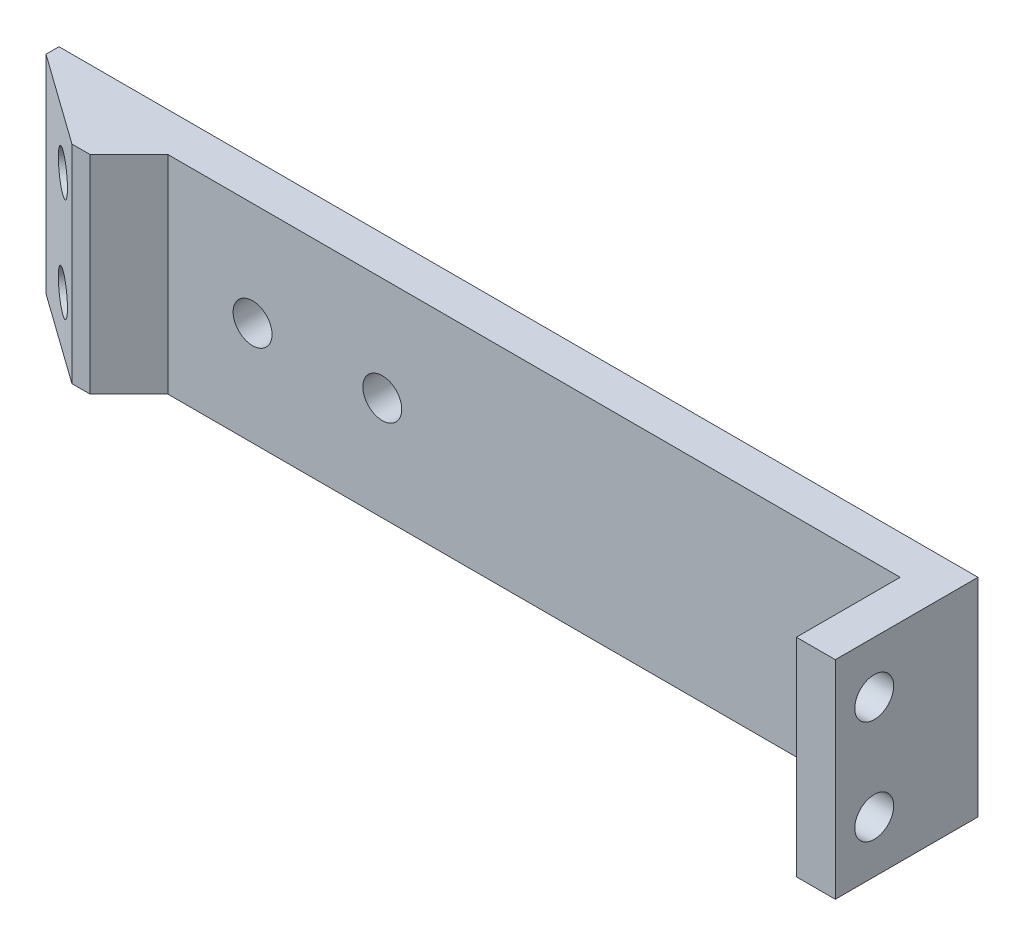
ISO-10303-21;
HEADER;
FILE_DESCRIPTION(('STEP AP214'),'2;1');
FILE_NAME('part.step','',(''),(''),'','','');
FILE_SCHEMA(('AUTOMOTIVE_DESIGN { 1 0 10303 214 1 1 1 1 }'));
ENDSEC;
DATA;
#1=APPLICATION_CONTEXT('core data for automotive mechanical design processes');
#2=APPLICATION_PROTOCOL_DEFINITION('international standard','automotive_design',2000,#1);
#3=PRODUCT_CONTEXT('',#1,'mechanical');
#4=PRODUCT('Part','Part','',(#3));
#5=PRODUCT_RELATED_PRODUCT_CATEGORY('part','',(#4));
#6=PRODUCT_DEFINITION_FORMATION('','',#4);
#7=PRODUCT_DEFINITION_CONTEXT('part definition',#1,'design');
#8=PRODUCT_DEFINITION('design','',#6,#7);
#9=PRODUCT_DEFINITION_SHAPE('','',#8);
#10=(LENGTH_UNIT() NAMED_UNIT(*) SI_UNIT(.MILLI.,.METRE.));
#11=(NAMED_UNIT(*) PLANE_ANGLE_UNIT() SI_UNIT($,.RADIAN.));
#12=(NAMED_UNIT(*) SI_UNIT($,.STERADIAN.) SOLID_ANGLE_UNIT());
#13=UNCERTAINTY_MEASURE_WITH_UNIT(LENGTH_MEASURE(1.E-05),#10,'distance_accuracy_value','');
#14=(GEOMETRIC_REPRESENTATION_CONTEXT(3) GLOBAL_UNCERTAINTY_ASSIGNED_CONTEXT((#13)) GLOBAL_UNIT_ASSIGNED_CONTEXT((#10,
#11,#12)) REPRESENTATION_CONTEXT('',''));
#15=CARTESIAN_POINT('',(0.,0.,0.));
#16=DIRECTION('',(0.,0.,1.));
#17=DIRECTION('',(1.,0.,0.));
#18=AXIS2_PLACEMENT_3D('',#15,#16,#17);
#19=CARTESIAN_POINT('',(0.,0.,3.));
#20=DIRECTION('',(0.,0.,-1.));
#21=DIRECTION('',(-1.,0.,0.));
#22=AXIS2_PLACEMENT_3D('',#19,#20,#21);
#23=PLANE('',#22);
#24=CARTESIAN_POINT('',(-7.5,0.,3.));
#25=DIRECTION('',(0.,0.,1.));
#26=DIRECTION('',(1.,0.,0.));
#27=AXIS2_PLACEMENT_3D('',#24,#25,#26);
#28=CIRCLE('',#27,1.5);
#29=CARTESIAN_POINT('',(-6.,0.,3.));
#30=VERTEX_POINT('',#29);
#31=EDGE_CURVE('E681',#30,#30,#28,.T.);
#32=ORIENTED_EDGE('',*,*,#31,.F.);
#33=EDGE_LOOP('',(#32));
#34=FACE_BOUND('',#33,.T.);
#35=CARTESIAN_POINT('',(-17.5,0.,3.));
#36=DIRECTION('',(0.,0.,-1.));
#37=DIRECTION('',(-1.,0.,0.));
#38=AXIS2_PLACEMENT_3D('',#35,#36,#37);
#39=CIRCLE('',#38,1.5);
#40=CARTESIAN_POINT('',(-19.,0.,3.));
#41=VERTEX_POINT('',#40);
#42=EDGE_CURVE('E687',#41,#41,#39,.T.);
#43=ORIENTED_EDGE('',*,*,#42,.T.);
#44=EDGE_LOOP('',(#43));
#45=FACE_BOUND('',#44,.T.);
#46=DIRECTION('',(0.,-1.,0.));
#47=VECTOR('',#46,1.);
#48=CARTESIAN_POINT('',(32.425,8.,3.));
#49=LINE('',#48,#47);
#50=CARTESIAN_POINT('',(32.425,8.,3.));
#51=VERTEX_POINT('',#50);
#52=CARTESIAN_POINT('',(32.425,-8.,3.));
#53=VERTEX_POINT('',#52);
#54=EDGE_CURVE('E53',#51,#53,#49,.T.);
#55=ORIENTED_EDGE('',*,*,#54,.F.);
#56=DIRECTION('',(-1.,0.,0.));
#57=VECTOR('',#56,1.);
#58=CARTESIAN_POINT('',(-35.425,8.,3.));
#59=LINE('',#58,#57);
#60=CARTESIAN_POINT('',(-24.025,8.,3.));
#61=VERTEX_POINT('',#60);
#62=EDGE_CURVE('E296',#51,#61,#59,.T.);
#63=ORIENTED_EDGE('',*,*,#62,.T.);
#64=DIRECTION('',(0.,-1.,0.));
#65=VECTOR('',#64,1.);
#66=CARTESIAN_POINT('',(-24.025,-8.,3.));
#67=LINE('',#66,#65);
#68=CARTESIAN_POINT('',(-24.025,-8.,3.));
#69=VERTEX_POINT('',#68);
#70=EDGE_CURVE('E320',#61,#69,#67,.T.);
#71=ORIENTED_EDGE('',*,*,#70,.T.);
#72=DIRECTION('',(1.,0.,0.));
#73=VECTOR('',#72,1.);
#74=CARTESIAN_POINT('',(-35.425,-8.,3.));
#75=LINE('',#74,#73);
#76=EDGE_CURVE('E58',#69,#53,#75,.T.);
#77=ORIENTED_EDGE('',*,*,#76,.T.);
#78=EDGE_LOOP('',(#55,#63,#71,#77));
#79=FACE_BOUND('',#78,.T.);
#80=ADVANCED_FACE('F35',(#34,#45,#79),#23,.F.);
#81=CARTESIAN_POINT('',(35.425,-8.,3.));
#82=DIRECTION('',(-1.,0.,0.));
#83=DIRECTION('',(0.,0.,1.));
#84=AXIS2_PLACEMENT_3D('',#81,#82,#83);
#85=PLANE('',#84);
#86=CARTESIAN_POINT('',(35.425,4.,8.));
#87=DIRECTION('',(1.,0.,0.));
#88=DIRECTION('',(0.,0.,-1.));
#89=AXIS2_PLACEMENT_3D('',#86,#87,#88);
#90=CIRCLE('',#89,1.5);
#91=CARTESIAN_POINT('',(35.425,4.,6.5));
#92=VERTEX_POINT('',#91);
#93=EDGE_CURVE('E356',#92,#92,#90,.T.);
#94=ORIENTED_EDGE('',*,*,#93,.F.);
#95=EDGE_LOOP('',(#94));
#96=FACE_BOUND('',#95,.T.);
#97=CARTESIAN_POINT('',(35.425,-4.,8.));
#98=DIRECTION('',(1.,0.,0.));
#99=DIRECTION('',(0.,0.,-1.));
#100=AXIS2_PLACEMENT_3D('',#97,#98,#99);
#101=CIRCLE('',#100,1.5);
#102=CARTESIAN_POINT('',(35.425,-4.,6.5));
#103=VERTEX_POINT('',#102);
#104=EDGE_CURVE('E210',#103,#103,#101,.T.);
#105=ORIENTED_EDGE('',*,*,#104,.F.);
#106=EDGE_LOOP('',(#105));
#107=FACE_BOUND('',#106,.T.);
#108=DIRECTION('',(0.,1.,0.));
#109=VECTOR('',#108,1.);
#110=CARTESIAN_POINT('',(35.425,-8.,0.));
#111=LINE('',#110,#109);
#112=CARTESIAN_POINT('',(35.425,-8.,0.));
#113=VERTEX_POINT('',#112);
#114=CARTESIAN_POINT('',(35.425,8.,0.));
#115=VERTEX_POINT('',#114);
#116=EDGE_CURVE('E186',#113,#115,#111,.T.);
#117=ORIENTED_EDGE('',*,*,#116,.T.);
#118=DIRECTION('',(0.,0.,-1.));
#119=VECTOR('',#118,1.);
#120=CARTESIAN_POINT('',(35.425,8.,3.));
#121=LINE('',#120,#119);
#122=CARTESIAN_POINT('',(35.425,8.,11.));
#123=VERTEX_POINT('',#122);
#124=EDGE_CURVE('E179',#123,#115,#121,.T.);
#125=ORIENTED_EDGE('',*,*,#124,.F.);
#126=DIRECTION('',(0.,1.,0.));
#127=VECTOR('',#126,1.);
#128=CARTESIAN_POINT('',(35.425,8.,11.));
#129=LINE('',#128,#127);
#130=CARTESIAN_POINT('',(35.425,-8.,11.));
#131=VERTEX_POINT('',#130);
#132=EDGE_CURVE('E184',#131,#123,#129,.T.);
#133=ORIENTED_EDGE('',*,*,#132,.F.);
#134=DIRECTION('',(0.,0.,-1.));
#135=VECTOR('',#134,1.);
#136=CARTESIAN_POINT('',(35.425,-8.,3.));
#137=LINE('',#136,#135);
#138=EDGE_CURVE('E300',#131,#113,#137,.T.);
#139=ORIENTED_EDGE('',*,*,#138,.T.);
#140=EDGE_LOOP('',(#117,#125,#133,#139));
#141=FACE_BOUND('',#140,.T.);
#142=ADVANCED_FACE('F181',(#96,#107,#141),#85,.F.);
#143=CARTESIAN_POINT('',(-35.425,8.,3.));
#144=DIRECTION('',(0.,-1.,0.));
#145=DIRECTION('',(0.,0.,-1.));
#146=AXIS2_PLACEMENT_3D('',#143,#144,#145);
#147=PLANE('',#146);
#148=DIRECTION('',(0.,0.,-1.));
#149=VECTOR('',#148,1.);
#150=CARTESIAN_POINT('',(-35.425,8.,3.));
#151=LINE('',#150,#149);
#152=CARTESIAN_POINT('',(-35.425,8.,0.999999999999988));
#153=VERTEX_POINT('',#152);
#154=CARTESIAN_POINT('',(-35.425,8.,0.));
#155=VERTEX_POINT('',#154);
#156=EDGE_CURVE('E190',#153,#155,#151,.T.);
#157=ORIENTED_EDGE('',*,*,#156,.F.);
#158=DIRECTION('',(0.813733471206736,0.,0.581238193719095));
#159=VECTOR('',#158,1.);
#160=CARTESIAN_POINT('',(-28.425,8.,6.));
#161=LINE('',#160,#159);
#162=CARTESIAN_POINT('',(-28.425,8.,6.));
#163=VERTEX_POINT('',#162);
#164=EDGE_CURVE('E318',#153,#163,#161,.T.);
#165=ORIENTED_EDGE('',*,*,#164,.T.);
#166=DIRECTION('',(-1.,0.,0.));
#167=VECTOR('',#166,1.);
#168=CARTESIAN_POINT('',(-35.425,8.,6.));
#169=LINE('',#168,#167);
#170=CARTESIAN_POINT('',(-27.025,8.,6.));
#171=VERTEX_POINT('',#170);
#172=EDGE_CURVE('E293',#171,#163,#169,.T.);
#173=ORIENTED_EDGE('',*,*,#172,.F.);
#174=DIRECTION('',(-0.707106781186546,0.,0.707106781186549));
#175=VECTOR('',#174,1.);
#176=CARTESIAN_POINT('',(-29.725,8.,8.69999999999999));
#177=LINE('',#176,#175);
#178=EDGE_CURVE('E322',#171,#61,#177,.F.);
#179=ORIENTED_EDGE('',*,*,#178,.T.);
#180=ORIENTED_EDGE('',*,*,#62,.F.);
#181=DIRECTION('',(0.,0.,-1.));
#182=VECTOR('',#181,1.);
#183=CARTESIAN_POINT('',(32.425,8.,11.));
#184=LINE('',#183,#182);
#185=CARTESIAN_POINT('',(32.425,8.,11.));
#186=VERTEX_POINT('',#185);
#187=EDGE_CURVE('E197',#186,#51,#184,.T.);
#188=ORIENTED_EDGE('',*,*,#187,.F.);
#189=DIRECTION('',(-1.,0.,0.));
#190=VECTOR('',#189,1.);
#191=CARTESIAN_POINT('',(35.425,8.,11.));
#192=LINE('',#191,#190);
#193=EDGE_CURVE('E193',#123,#186,#192,.T.);
#194=ORIENTED_EDGE('',*,*,#193,.F.);
#195=ORIENTED_EDGE('',*,*,#124,.T.);
#196=DIRECTION('',(-1.,0.,0.));
#197=VECTOR('',#196,1.);
#198=CARTESIAN_POINT('',(-35.425,8.,0.));
#199=LINE('',#198,#197);
#200=EDGE_CURVE('E302',#115,#155,#199,.T.);
#201=ORIENTED_EDGE('',*,*,#200,.T.);
#202=EDGE_LOOP('',(#157,#165,#173,#179,#180,#188,#194,#195,#201));
#203=FACE_BOUND('',#202,.T.);
#204=ADVANCED_FACE('F195',(#203),#147,.F.);
#205=CARTESIAN_POINT('',(-35.425,-8.,3.));
#206=DIRECTION('',(1.,0.,0.));
#207=DIRECTION('',(0.,0.,-1.));
#208=AXIS2_PLACEMENT_3D('',#205,#206,#207);
#209=PLANE('',#208);
#210=DIRECTION('',(0.,0.,-1.));
#211=VECTOR('',#210,1.);
#212=CARTESIAN_POINT('',(-35.425,-8.,3.));
#213=LINE('',#212,#211);
#214=CARTESIAN_POINT('',(-35.425,-8.,0.999999999999988));
#215=VERTEX_POINT('',#214);
#216=CARTESIAN_POINT('',(-35.425,-8.,0.));
#217=VERTEX_POINT('',#216);
#218=EDGE_CURVE('E309',#215,#217,#213,.T.);
#219=ORIENTED_EDGE('',*,*,#218,.F.);
#220=DIRECTION('',(0.,1.,0.));
#221=VECTOR('',#220,1.);
#222=CARTESIAN_POINT('',(-35.425,8.,0.999999999999988));
#223=LINE('',#222,#221);
#224=EDGE_CURVE('E316',#215,#153,#223,.T.);
#225=ORIENTED_EDGE('',*,*,#224,.T.);
#226=ORIENTED_EDGE('',*,*,#156,.T.);
#227=DIRECTION('',(0.,-1.,0.));
#228=VECTOR('',#227,1.);
#229=CARTESIAN_POINT('',(-35.425,-8.,0.));
#230=LINE('',#229,#228);
#231=EDGE_CURVE('E304',#155,#217,#230,.T.);
#232=ORIENTED_EDGE('',*,*,#231,.T.);
#233=EDGE_LOOP('',(#219,#225,#226,#232));
#234=FACE_BOUND('',#233,.T.);
#235=ADVANCED_FACE('F400',(#234),#209,.F.);
#236=CARTESIAN_POINT('',(-35.425,-8.,3.));
#237=DIRECTION('',(0.,1.,0.));
#238=DIRECTION('',(0.,0.,1.));
#239=AXIS2_PLACEMENT_3D('',#236,#237,#238);
#240=PLANE('',#239);
#241=DIRECTION('',(1.,0.,0.));
#242=VECTOR('',#241,1.);
#243=CARTESIAN_POINT('',(-35.425,-8.,6.));
#244=LINE('',#243,#242);
#245=CARTESIAN_POINT('',(-28.425,-8.,6.));
#246=VERTEX_POINT('',#245);
#247=CARTESIAN_POINT('',(-27.025,-8.,6.));
#248=VERTEX_POINT('',#247);
#249=EDGE_CURVE('E283',#246,#248,#244,.T.);
#250=ORIENTED_EDGE('',*,*,#249,.F.);
#251=DIRECTION('',(-0.813733471206736,0.,-0.581238193719095));
#252=VECTOR('',#251,1.);
#253=CARTESIAN_POINT('',(-28.425,-8.,6.));
#254=LINE('',#253,#252);
#255=EDGE_CURVE('E314',#246,#215,#254,.T.);
#256=ORIENTED_EDGE('',*,*,#255,.T.);
#257=ORIENTED_EDGE('',*,*,#218,.T.);
#258=DIRECTION('',(1.,0.,0.));
#259=VECTOR('',#258,1.);
#260=CARTESIAN_POINT('',(-35.425,-8.,0.));
#261=LINE('',#260,#259);
#262=EDGE_CURVE('E298',#217,#113,#261,.T.);
#263=ORIENTED_EDGE('',*,*,#262,.T.);
#264=ORIENTED_EDGE('',*,*,#138,.F.);
#265=DIRECTION('',(1.,0.,0.));
#266=VECTOR('',#265,1.);
#267=CARTESIAN_POINT('',(35.425,-8.,11.));
#268=LINE('',#267,#266);
#269=CARTESIAN_POINT('',(32.425,-8.,11.));
#270=VERTEX_POINT('',#269);
#271=EDGE_CURVE('E205',#270,#131,#268,.T.);
#272=ORIENTED_EDGE('',*,*,#271,.F.);
#273=DIRECTION('',(0.,0.,-1.));
#274=VECTOR('',#273,1.);
#275=CARTESIAN_POINT('',(32.425,-8.,11.));
#276=LINE('',#275,#274);
#277=EDGE_CURVE('E214',#270,#53,#276,.T.);
#278=ORIENTED_EDGE('',*,*,#277,.T.);
#279=ORIENTED_EDGE('',*,*,#76,.F.);
#280=DIRECTION('',(0.707106781186546,0.,-0.707106781186549));
#281=VECTOR('',#280,1.);
#282=CARTESIAN_POINT('',(-29.725,-8.,8.69999999999999));
#283=LINE('',#282,#281);
#284=EDGE_CURVE('E325',#69,#248,#283,.F.);
#285=ORIENTED_EDGE('',*,*,#284,.T.);
#286=EDGE_LOOP('',(#250,#256,#257,#263,#264,#272,#278,#279,#285));
#287=FACE_BOUND('',#286,.T.);
#288=ADVANCED_FACE('F396',(#287),#240,.F.);
#289=CARTESIAN_POINT('',(0.,0.,0.));
#290=DIRECTION('',(0.,0.,-1.));
#291=DIRECTION('',(-1.,0.,0.));
#292=AXIS2_PLACEMENT_3D('',#289,#290,#291);
#293=PLANE('',#292);
#294=CARTESIAN_POINT('',(-7.5,0.,0.));
#295=DIRECTION('',(0.,0.,-1.));
#296=DIRECTION('',(-1.,0.,0.));
#297=AXIS2_PLACEMENT_3D('',#294,#295,#296);
#298=CIRCLE('',#297,1.5);
#299=CARTESIAN_POINT('',(-9.,0.,0.));
#300=VERTEX_POINT('',#299);
#301=EDGE_CURVE('E40',#300,#300,#298,.T.);
#302=ORIENTED_EDGE('',*,*,#301,.F.);
#303=EDGE_LOOP('',(#302));
#304=FACE_BOUND('',#303,.T.);
#305=CARTESIAN_POINT('',(-17.5,0.,0.));
#306=DIRECTION('',(0.,0.,-1.));
#307=DIRECTION('',(-1.,0.,0.));
#308=AXIS2_PLACEMENT_3D('',#305,#306,#307);
#309=CIRCLE('',#308,1.5);
#310=CARTESIAN_POINT('',(-19.,0.,0.));
#311=VERTEX_POINT('',#310);
#312=EDGE_CURVE('E683',#311,#311,#309,.T.);
#313=ORIENTED_EDGE('',*,*,#312,.F.);
#314=EDGE_LOOP('',(#313));
#315=FACE_BOUND('',#314,.T.);
#316=DIRECTION('',(1.,0.,0.));
#317=VECTOR('',#316,1.);
#318=CARTESIAN_POINT('',(0.,6.75000000000001,0.));
#319=LINE('',#318,#317);
#320=CARTESIAN_POINT('',(-29.7771430749619,6.75,0.));
#321=VERTEX_POINT('',#320);
#322=CARTESIAN_POINT('',(-25.8748500110746,6.75,0.));
#323=VERTEX_POINT('',#322);
#324=EDGE_CURVE('E11',#321,#323,#319,.T.);
#325=ORIENTED_EDGE('',*,*,#324,.F.);
#326=DIRECTION('',(0.578655017224664,0.815572419249649,0.));
#327=VECTOR('',#326,1.);
#328=CARTESIAN_POINT('',(-22.9920777200731,16.3130591657087,0.));
#329=LINE('',#328,#327);
#330=CARTESIAN_POINT('',(-31.6636048397744,4.09116850359432,0.));
#331=VERTEX_POINT('',#330);
#332=EDGE_CURVE('E344',#331,#321,#329,.T.);
#333=ORIENTED_EDGE('',*,*,#332,.F.);
#334=DIRECTION('',(0.,1.,0.));
#335=VECTOR('',#334,1.);
#336=CARTESIAN_POINT('',(-31.6636048397744,0.,0.));
#337=LINE('',#336,#335);
#338=CARTESIAN_POINT('',(-31.6636048397744,3.90883149640569,0.));
#339=VERTEX_POINT('',#338);
#340=EDGE_CURVE('E342',#339,#331,#337,.T.);
#341=ORIENTED_EDGE('',*,*,#340,.F.);
#342=DIRECTION('',(-0.578655017224664,0.815572419249648,0.));
#343=VECTOR('',#342,1.);
#344=CARTESIAN_POINT('',(-19.2165971416021,-13.6343261340345,0.));
#345=LINE('',#344,#343);
#346=CARTESIAN_POINT('',(-29.7771430749618,1.25,0.));
#347=VERTEX_POINT('',#346);
#348=EDGE_CURVE('E346',#347,#339,#345,.T.);
#349=ORIENTED_EDGE('',*,*,#348,.F.);
#350=DIRECTION('',(-1.,0.,0.));
#351=VECTOR('',#350,1.);
#352=CARTESIAN_POINT('',(0.,1.25,0.));
#353=LINE('',#352,#351);
#354=CARTESIAN_POINT('',(-25.8748500110746,1.25,0.));
#355=VERTEX_POINT('',#354);
#356=EDGE_CURVE('E349',#355,#347,#353,.T.);
#357=ORIENTED_EDGE('',*,*,#356,.F.);
#358=DIRECTION('',(-0.578655017224663,-0.815572419249649,0.));
#359=VECTOR('',#358,1.);
#360=CARTESIAN_POINT('',(-17.8007919246755,12.6298012471566,0.));
#361=LINE('',#360,#359);
#362=CARTESIAN_POINT('',(-23.923703479131,4.00000000000001,0.));
#363=VERTEX_POINT('',#362);
#364=EDGE_CURVE('E351',#363,#355,#361,.T.);
#365=ORIENTED_EDGE('',*,*,#364,.F.);
#366=DIRECTION('',(0.578655017224664,-0.815572419249648,0.));
#367=VECTOR('',#366,1.);
#368=CARTESIAN_POINT('',(-14.0253113462046,-9.95106821548243,0.));
#369=LINE('',#368,#367);
#370=EDGE_CURVE('E45',#323,#363,#369,.T.);
#371=ORIENTED_EDGE('',*,*,#370,.F.);
#372=EDGE_LOOP('',(#325,#333,#341,#349,#357,#365,#371));
#373=FACE_BOUND('',#372,.T.);
#374=DIRECTION('',(1.,0.,0.));
#375=VECTOR('',#374,1.);
#376=CARTESIAN_POINT('',(0.,-1.25,0.));
#377=LINE('',#376,#375);
#378=CARTESIAN_POINT('',(-29.7771430749619,-1.25,0.));
#379=VERTEX_POINT('',#378);
#380=CARTESIAN_POINT('',(-25.8748500110746,-1.25,0.));
#381=VERTEX_POINT('',#380);
#382=EDGE_CURVE('E340',#379,#381,#377,.T.);
#383=ORIENTED_EDGE('',*,*,#382,.F.);
#384=DIRECTION('',(0.578655017224664,0.815572419249648,0.));
#385=VECTOR('',#384,1.);
#386=CARTESIAN_POINT('',(-19.2165971416021,13.6343261340345,0.));
#387=LINE('',#386,#385);
#388=CARTESIAN_POINT('',(-31.6636048397744,-3.90883149640568,0.));
#389=VERTEX_POINT('',#388);
#390=EDGE_CURVE('E329',#389,#379,#387,.T.);
#391=ORIENTED_EDGE('',*,*,#390,.F.);
#392=DIRECTION('',(0.,1.,0.));
#393=VECTOR('',#392,1.);
#394=CARTESIAN_POINT('',(-31.6636048397744,0.,0.));
#395=LINE('',#394,#393);
#396=CARTESIAN_POINT('',(-31.6636048397744,-4.0911685035943,0.));
#397=VERTEX_POINT('',#396);
#398=EDGE_CURVE('E327',#397,#389,#395,.T.);
#399=ORIENTED_EDGE('',*,*,#398,.F.);
#400=DIRECTION('',(-0.578655017224665,0.815572419249648,0.));
#401=VECTOR('',#400,1.);
#402=CARTESIAN_POINT('',(-22.992077720073,-16.3130591657087,0.));
#403=LINE('',#402,#401);
#404=CARTESIAN_POINT('',(-29.7771430749618,-6.74999999999999,0.));
#405=VERTEX_POINT('',#404);
#406=EDGE_CURVE('E331',#405,#397,#403,.T.);
#407=ORIENTED_EDGE('',*,*,#406,.F.);
#408=DIRECTION('',(-1.,0.,0.));
#409=VECTOR('',#408,1.);
#410=CARTESIAN_POINT('',(0.,-6.74999999999999,0.));
#411=LINE('',#410,#409);
#412=CARTESIAN_POINT('',(-25.8748500110746,-6.74999999999999,0.));
#413=VERTEX_POINT('',#412);
#414=EDGE_CURVE('E334',#413,#405,#411,.T.);
#415=ORIENTED_EDGE('',*,*,#414,.F.);
#416=DIRECTION('',(-0.578655017224663,-0.815572419249649,0.));
#417=VECTOR('',#416,1.);
#418=CARTESIAN_POINT('',(-14.0253113462046,9.95106821548244,0.));
#419=LINE('',#418,#417);
#420=CARTESIAN_POINT('',(-23.923703479131,-4.,0.));
#421=VERTEX_POINT('',#420);
#422=EDGE_CURVE('E336',#421,#413,#419,.T.);
#423=ORIENTED_EDGE('',*,*,#422,.F.);
#424=DIRECTION('',(0.578655017224663,-0.815572419249649,0.));
#425=VECTOR('',#424,1.);
#426=CARTESIAN_POINT('',(-17.8007919246756,-12.6298012471566,0.));
#427=LINE('',#426,#425);
#428=EDGE_CURVE('E338',#381,#421,#427,.T.);
#429=ORIENTED_EDGE('',*,*,#428,.F.);
#430=EDGE_LOOP('',(#383,#391,#399,#407,#415,#423,#429));
#431=FACE_BOUND('',#430,.T.);
#432=ORIENTED_EDGE('',*,*,#116,.F.);
#433=ORIENTED_EDGE('',*,*,#262,.F.);
#434=ORIENTED_EDGE('',*,*,#231,.F.);
#435=ORIENTED_EDGE('',*,*,#200,.F.);
#436=EDGE_LOOP('',(#432,#433,#434,#435));
#437=FACE_BOUND('',#436,.T.);
#438=ADVANCED_FACE('F393',(#304,#315,#373,#431,#437),#293,.T.);
#439=CARTESIAN_POINT('',(0.,0.,6.));
#440=DIRECTION('',(0.,0.,1.));
#441=DIRECTION('',(1.,0.,0.));
#442=AXIS2_PLACEMENT_3D('',#439,#440,#441);
#443=PLANE('',#442);
#444=ORIENTED_EDGE('',*,*,#172,.T.);
#445=DIRECTION('',(0.,-1.,0.));
#446=VECTOR('',#445,1.);
#447=CARTESIAN_POINT('',(-28.425,-8.,6.));
#448=LINE('',#447,#446);
#449=EDGE_CURVE('E189',#163,#246,#448,.T.);
#450=ORIENTED_EDGE('',*,*,#449,.T.);
#451=ORIENTED_EDGE('',*,*,#249,.T.);
#452=DIRECTION('',(0.,1.,0.));
#453=VECTOR('',#452,1.);
#454=CARTESIAN_POINT('',(-27.025,8.,6.));
#455=LINE('',#454,#453);
#456=EDGE_CURVE('E290',#248,#171,#455,.T.);
#457=ORIENTED_EDGE('',*,*,#456,.T.);
#458=EDGE_LOOP('',(#444,#450,#451,#457));
#459=FACE_BOUND('',#458,.T.);
#460=ADVANCED_FACE('F391',(#459),#443,.T.);
#461=CARTESIAN_POINT('',(-28.425,0.,6.));
#462=DIRECTION('',(-0.581238193719095,0.,0.813733471206736));
#463=DIRECTION('',(0.,1.,0.));
#464=AXIS2_PLACEMENT_3D('',#461,#462,#463);
#465=PLANE('',#464);
#466=CARTESIAN_POINT('',(-30.8662004136202,4.,4.2562854188427));
#467=DIRECTION('',(-0.581238193719096,0.,0.813733471206735));
#468=DIRECTION('',(0.813733471206735,0.,0.581238193719096));
#469=AXIS2_PLACEMENT_3D('',#466,#467,#468);
#470=CIRCLE('',#469,1.5);
#471=CARTESIAN_POINT('',(-29.64560020681,4.,5.12814270942134));
#472=VERTEX_POINT('',#471);
#473=EDGE_CURVE('E280',#472,#472,#470,.T.);
#474=ORIENTED_EDGE('',*,*,#473,.F.);
#475=EDGE_LOOP('',(#474));
#476=FACE_BOUND('',#475,.T.);
#477=CARTESIAN_POINT('',(-30.8662004136202,-4.,4.2562854188427));
#478=DIRECTION('',(-0.581238193719096,0.,0.813733471206735));
#479=DIRECTION('',(0.813733471206735,0.,0.581238193719096));
#480=AXIS2_PLACEMENT_3D('',#477,#478,#479);
#481=CIRCLE('',#480,1.5);
#482=CARTESIAN_POINT('',(-29.64560020681,-4.,5.12814270942134));
#483=VERTEX_POINT('',#482);
#484=EDGE_CURVE('E279',#483,#483,#481,.T.);
#485=ORIENTED_EDGE('',*,*,#484,.F.);
#486=EDGE_LOOP('',(#485));
#487=FACE_BOUND('',#486,.T.);
#488=ORIENTED_EDGE('',*,*,#164,.F.);
#489=ORIENTED_EDGE('',*,*,#224,.F.);
#490=ORIENTED_EDGE('',*,*,#255,.F.);
#491=ORIENTED_EDGE('',*,*,#449,.F.);
#492=EDGE_LOOP('',(#488,#489,#490,#491));
#493=FACE_BOUND('',#492,.T.);
#494=ADVANCED_FACE('F407',(#476,#487,#493),#465,.T.);
#495=CARTESIAN_POINT('',(-29.1224858324629,-4.,1.81508500522249));
#496=DIRECTION('',(-0.581238193719096,0.,0.813733471206735));
#497=DIRECTION('',(0.813733471206735,0.,0.581238193719096));
#498=AXIS2_PLACEMENT_3D('',#495,#496,#497);
#499=CYLINDRICAL_SURFACE('',#498,1.5);
#500=CARTESIAN_POINT('',(-29.1224858324629,-4.,1.81508500522249));
#501=DIRECTION('',(-0.581238193719096,0.,0.813733471206735));
#502=DIRECTION('',(0.813733471206735,0.,0.581238193719096));
#503=AXIS2_PLACEMENT_3D('',#500,#501,#502);
#504=CIRCLE('',#503,1.5);
#505=CARTESIAN_POINT('',(-27.9018856256528,-4.,2.68694229580113));
#506=VERTEX_POINT('',#505);
#507=EDGE_CURVE('E242',#506,#506,#504,.T.);
#508=ORIENTED_EDGE('',*,*,#507,.F.);
#509=EDGE_LOOP('',(#508));
#510=FACE_BOUND('',#509,.T.);
#511=ORIENTED_EDGE('',*,*,#484,.T.);
#512=EDGE_LOOP('',(#511));
#513=FACE_BOUND('',#512,.T.);
#514=ADVANCED_FACE('F411',(#510,#513),#499,.F.);
#515=CARTESIAN_POINT('',(-29.1224858324629,4.,1.81508500522249));
#516=DIRECTION('',(-0.581238193719096,0.,0.813733471206735));
#517=DIRECTION('',(0.813733471206735,0.,0.581238193719096));
#518=AXIS2_PLACEMENT_3D('',#515,#516,#517);
#519=CYLINDRICAL_SURFACE('',#518,1.5);
#520=CARTESIAN_POINT('',(-29.1224858324629,4.,1.81508500522249));
#521=DIRECTION('',(-0.581238193719096,0.,0.813733471206735));
#522=DIRECTION('',(0.813733471206735,0.,0.581238193719096));
#523=AXIS2_PLACEMENT_3D('',#520,#521,#522);
#524=CIRCLE('',#523,1.5);
#525=CARTESIAN_POINT('',(-27.9018856256528,4.,2.68694229580113));
#526=VERTEX_POINT('',#525);
#527=EDGE_CURVE('E276',#526,#526,#524,.T.);
#528=ORIENTED_EDGE('',*,*,#527,.F.);
#529=EDGE_LOOP('',(#528));
#530=FACE_BOUND('',#529,.T.);
#531=ORIENTED_EDGE('',*,*,#473,.T.);
#532=EDGE_LOOP('',(#531));
#533=FACE_BOUND('',#532,.T.);
#534=ADVANCED_FACE('F417',(#530,#533),#519,.F.);
#535=CARTESIAN_POINT('',(-27.025,8.,6.));
#536=DIRECTION('',(0.707106781186549,0.,0.707106781186546));
#537=DIRECTION('',(0.,-1.,0.));
#538=AXIS2_PLACEMENT_3D('',#535,#536,#537);
#539=PLANE('',#538);
#540=ORIENTED_EDGE('',*,*,#284,.F.);
#541=ORIENTED_EDGE('',*,*,#70,.F.);
#542=ORIENTED_EDGE('',*,*,#178,.F.);
#543=ORIENTED_EDGE('',*,*,#456,.F.);
#544=EDGE_LOOP('',(#540,#541,#542,#543));
#545=FACE_BOUND('',#544,.T.);
#546=ADVANCED_FACE('F38',(#545),#539,.T.);
#547=CARTESIAN_POINT('',(-23.1806048764231,-6.74999999999999,-3.77194318851211));
#548=DIRECTION('',(0.704713857974726,-0.499999999999999,0.503367041410518));
#549=DIRECTION('',(0.581238193719096,0.,-0.813733471206735));
#550=AXIS2_PLACEMENT_3D('',#547,#548,#549);
#551=PLANE('',#550);
#552=ORIENTED_EDGE('',*,*,#422,.T.);
#553=DIRECTION('',(-0.581238193719096,0.,0.813733471206735));
#554=VECTOR('',#553,1.);
#555=CARTESIAN_POINT('',(-23.1806048764231,-6.74999999999999,-3.77194318851211));
#556=LINE('',#555,#554);
#557=CARTESIAN_POINT('',(-27.8305104261759,-6.74999999999999,2.73792458114178));
#558=VERTEX_POINT('',#557);
#559=EDGE_CURVE('E224',#413,#558,#556,.T.);
#560=ORIENTED_EDGE('',*,*,#559,.T.);
#561=DIRECTION('',(0.406866735603367,0.866025403784439,0.290619096859548));
#562=VECTOR('',#561,1.);
#563=CARTESIAN_POINT('',(-27.8305104261759,-6.74999999999999,2.73792458114178));
#564=LINE('',#563,#562);
#565=CARTESIAN_POINT('',(-26.5385350198889,-3.99999999999999,3.66076415706106));
#566=VERTEX_POINT('',#565);
#567=EDGE_CURVE('E219',#558,#566,#564,.T.);
#568=ORIENTED_EDGE('',*,*,#567,.T.);
#569=DIRECTION('',(-0.581238193719096,0.,0.813733471206735));
#570=VECTOR('',#569,1.);
#571=CARTESIAN_POINT('',(-21.8886294701361,-3.99999999999999,-2.84910361259282));
#572=LINE('',#571,#570);
#573=EDGE_CURVE('E267',#421,#566,#572,.T.);
#574=ORIENTED_EDGE('',*,*,#573,.F.);
#575=EDGE_LOOP('',(#552,#560,#568,#574));
#576=FACE_BOUND('',#575,.T.);
#577=ADVANCED_FACE('F483',(#576),#551,.F.);
#578=CARTESIAN_POINT('',(-25.7645556889971,-6.74999999999999,-5.61762234035067));
#579=DIRECTION('',(0.,-1.,0.));
#580=DIRECTION('',(0.,0.,-1.));
#581=AXIS2_PLACEMENT_3D('',#578,#579,#580);
#582=PLANE('',#581);
#583=ORIENTED_EDGE('',*,*,#414,.T.);
#584=DIRECTION('',(-0.581238193719096,0.,0.813733471206735));
#585=VECTOR('',#584,1.);
#586=CARTESIAN_POINT('',(-25.7645556889971,-6.74999999999999,-5.61762234035067));
#587=LINE('',#586,#585);
#588=CARTESIAN_POINT('',(-30.4144612387499,-6.74999999999999,0.892245429303217));
#589=VERTEX_POINT('',#588);
#590=EDGE_CURVE('E269',#405,#589,#587,.T.);
#591=ORIENTED_EDGE('',*,*,#590,.T.);
#592=DIRECTION('',(0.813733471206735,0.,0.581238193719096));
#593=VECTOR('',#592,1.);
#594=CARTESIAN_POINT('',(-30.4144612387499,-6.74999999999999,0.892245429303217));
#595=LINE('',#594,#593);
#596=EDGE_CURVE('E264',#589,#558,#595,.T.);
#597=ORIENTED_EDGE('',*,*,#596,.T.);
#598=ORIENTED_EDGE('',*,*,#559,.F.);
#599=EDGE_LOOP('',(#583,#591,#597,#598));
#600=FACE_BOUND('',#599,.T.);
#601=ADVANCED_FACE('F479',(#600),#582,.F.);
#602=CARTESIAN_POINT('',(-27.0565310952841,-3.99999999999999,-6.54046191626995));
#603=DIRECTION('',(-0.704713857974725,-0.500000000000001,-0.503367041410517));
#604=DIRECTION('',(-0.581238193719096,0.,0.813733471206735));
#605=AXIS2_PLACEMENT_3D('',#602,#603,#604);
#606=PLANE('',#605);
#607=ORIENTED_EDGE('',*,*,#406,.T.);
#608=DIRECTION('',(0.40686673560337,-0.866025403784438,0.290619096859547));
#609=VECTOR('',#608,1.);
#610=CARTESIAN_POINT('',(-31.7064366450369,-3.99999999999999,-0.030594146616064));
#611=LINE('',#610,#609);
#612=EDGE_CURVE('E261',#397,#589,#611,.T.);
#613=ORIENTED_EDGE('',*,*,#612,.T.);
#614=ORIENTED_EDGE('',*,*,#590,.F.);
#615=EDGE_LOOP('',(#607,#613,#614));
#616=FACE_BOUND('',#615,.T.);
#617=ADVANCED_FACE('F482',(#616),#606,.F.);
#618=CARTESIAN_POINT('',(-25.7645556889971,-1.25,-5.61762234035067));
#619=DIRECTION('',(-0.704713857974726,0.500000000000001,-0.503367041410517));
#620=DIRECTION('',(-0.581238193719096,0.,0.813733471206735));
#621=AXIS2_PLACEMENT_3D('',#618,#619,#620);
#622=PLANE('',#621);
#623=ORIENTED_EDGE('',*,*,#390,.T.);
#624=DIRECTION('',(-0.581238193719096,0.,0.813733471206735));
#625=VECTOR('',#624,1.);
#626=CARTESIAN_POINT('',(-25.7645556889971,-1.25,-5.61762234035067));
#627=LINE('',#626,#625);
#628=CARTESIAN_POINT('',(-30.4144612387499,-1.25,0.892245429303215));
#629=VERTEX_POINT('',#628);
#630=EDGE_CURVE('E271',#379,#629,#627,.T.);
#631=ORIENTED_EDGE('',*,*,#630,.T.);
#632=DIRECTION('',(-0.406866735603369,-0.866025403784438,-0.290619096859548));
#633=VECTOR('',#632,1.);
#634=CARTESIAN_POINT('',(-30.4144612387499,-1.25,0.892245429303215));
#635=LINE('',#634,#633);
#636=EDGE_CURVE('E258',#629,#389,#635,.T.);
#637=ORIENTED_EDGE('',*,*,#636,.T.);
#638=EDGE_LOOP('',(#623,#631,#637));
#639=FACE_BOUND('',#638,.T.);
#640=ADVANCED_FACE('F487',(#639),#622,.F.);
#641=CARTESIAN_POINT('',(-23.1806048764231,-1.25,-3.7719431885121));
#642=DIRECTION('',(0.,1.,0.));
#643=DIRECTION('',(-1.,0.,0.));
#644=AXIS2_PLACEMENT_3D('',#641,#642,#643);
#645=PLANE('',#644);
#646=ORIENTED_EDGE('',*,*,#382,.T.);
#647=DIRECTION('',(-0.581238193719096,0.,0.813733471206735));
#648=VECTOR('',#647,1.);
#649=CARTESIAN_POINT('',(-23.1806048764231,-1.25,-3.7719431885121));
#650=LINE('',#649,#648);
#651=CARTESIAN_POINT('',(-27.8305104261759,-1.25,2.73792458114178));
#652=VERTEX_POINT('',#651);
#653=EDGE_CURVE('E273',#381,#652,#650,.T.);
#654=ORIENTED_EDGE('',*,*,#653,.T.);
#655=DIRECTION('',(-0.813733471206735,0.,-0.581238193719096));
#656=VECTOR('',#655,1.);
#657=CARTESIAN_POINT('',(-27.8305104261759,-1.25,2.73792458114178));
#658=LINE('',#657,#656);
#659=EDGE_CURVE('E255',#652,#629,#658,.T.);
#660=ORIENTED_EDGE('',*,*,#659,.T.);
#661=ORIENTED_EDGE('',*,*,#630,.F.);
#662=EDGE_LOOP('',(#646,#654,#660,#661));
#663=FACE_BOUND('',#662,.T.);
#664=ADVANCED_FACE('F491',(#663),#645,.F.);
#665=CARTESIAN_POINT('',(-21.8886294701361,-3.99999999999999,-2.84910361259282));
#666=DIRECTION('',(0.704713857974726,0.499999999999999,0.503367041410518));
#667=DIRECTION('',(0.581238193719096,0.,-0.813733471206735));
#668=AXIS2_PLACEMENT_3D('',#665,#666,#667);
#669=PLANE('',#668);
#670=ORIENTED_EDGE('',*,*,#428,.T.);
#671=ORIENTED_EDGE('',*,*,#573,.T.);
#672=DIRECTION('',(-0.406866735603367,0.866025403784439,-0.290619096859547));
#673=VECTOR('',#672,1.);
#674=CARTESIAN_POINT('',(-26.5385350198889,-3.99999999999999,3.66076415706106));
#675=LINE('',#674,#673);
#676=EDGE_CURVE('E252',#566,#652,#675,.T.);
#677=ORIENTED_EDGE('',*,*,#676,.T.);
#678=ORIENTED_EDGE('',*,*,#653,.F.);
#679=EDGE_LOOP('',(#670,#671,#677,#678));
#680=FACE_BOUND('',#679,.T.);
#681=ADVANCED_FACE('F477',(#680),#669,.F.);
#682=CARTESIAN_POINT('',(-10.6971637972211,0.,14.9760293161095));
#683=DIRECTION('',(-0.581238193719096,0.,0.813733471206735));
#684=DIRECTION('',(0.813733471206735,0.,0.581238193719096));
#685=AXIS2_PLACEMENT_3D('',#682,#683,#684);
#686=PLANE('',#685);
#687=ORIENTED_EDGE('',*,*,#507,.T.);
#688=EDGE_LOOP('',(#687));
#689=FACE_BOUND('',#688,.T.);
#690=ORIENTED_EDGE('',*,*,#398,.T.);
#691=ORIENTED_EDGE('',*,*,#636,.F.);
#692=ORIENTED_EDGE('',*,*,#659,.F.);
#693=ORIENTED_EDGE('',*,*,#676,.F.);
#694=ORIENTED_EDGE('',*,*,#567,.F.);
#695=ORIENTED_EDGE('',*,*,#596,.F.);
#696=ORIENTED_EDGE('',*,*,#612,.F.);
#697=EDGE_LOOP('',(#690,#691,#692,#693,#694,#695,#696));
#698=FACE_BOUND('',#697,.T.);
#699=ADVANCED_FACE('F473',(#689,#698),#686,.F.);
#700=CARTESIAN_POINT('',(-23.1806048764231,1.25,-3.77194318851211));
#701=DIRECTION('',(0.704713857974726,-0.5,0.503367041410518));
#702=DIRECTION('',(0.581238193719096,0.,-0.813733471206735));
#703=AXIS2_PLACEMENT_3D('',#700,#701,#702);
#704=PLANE('',#703);
#705=ORIENTED_EDGE('',*,*,#364,.T.);
#706=DIRECTION('',(-0.581238193719096,0.,0.813733471206735));
#707=VECTOR('',#706,1.);
#708=CARTESIAN_POINT('',(-23.1806048764231,1.25,-3.77194318851211));
#709=LINE('',#708,#707);
#710=CARTESIAN_POINT('',(-27.8305104261759,1.25,2.73792458114178));
#711=VERTEX_POINT('',#710);
#712=EDGE_CURVE('E240',#355,#711,#709,.T.);
#713=ORIENTED_EDGE('',*,*,#712,.T.);
#714=DIRECTION('',(0.406866735603367,0.866025403784439,0.290619096859548));
#715=VECTOR('',#714,1.);
#716=CARTESIAN_POINT('',(-27.8305104261759,1.25,2.73792458114178));
#717=LINE('',#716,#715);
#718=CARTESIAN_POINT('',(-26.5385350198889,4.00000000000001,3.66076415706106));
#719=VERTEX_POINT('',#718);
#720=EDGE_CURVE('E220',#711,#719,#717,.T.);
#721=ORIENTED_EDGE('',*,*,#720,.T.);
#722=DIRECTION('',(-0.581238193719096,0.,0.813733471206735));
#723=VECTOR('',#722,1.);
#724=CARTESIAN_POINT('',(-21.8886294701361,4.00000000000001,-2.84910361259282));
#725=LINE('',#724,#723);
#726=EDGE_CURVE('E239',#363,#719,#725,.T.);
#727=ORIENTED_EDGE('',*,*,#726,.F.);
#728=EDGE_LOOP('',(#705,#713,#721,#727));
#729=FACE_BOUND('',#728,.T.);
#730=ADVANCED_FACE('F455',(#729),#704,.F.);
#731=CARTESIAN_POINT('',(-25.7645556889971,1.25,-5.61762234035067));
#732=DIRECTION('',(0.,-1.,0.));
#733=DIRECTION('',(1.,0.,0.));
#734=AXIS2_PLACEMENT_3D('',#731,#732,#733);
#735=PLANE('',#734);
#736=ORIENTED_EDGE('',*,*,#356,.T.);
#737=DIRECTION('',(-0.581238193719096,0.,0.813733471206735));
#738=VECTOR('',#737,1.);
#739=CARTESIAN_POINT('',(-25.7645556889971,1.25,-5.61762234035067));
#740=LINE('',#739,#738);
#741=CARTESIAN_POINT('',(-30.4144612387499,1.25,0.892245429303215));
#742=VERTEX_POINT('',#741);
#743=EDGE_CURVE('E243',#347,#742,#740,.T.);
#744=ORIENTED_EDGE('',*,*,#743,.T.);
#745=DIRECTION('',(0.813733471206736,0.,0.581238193719096));
#746=VECTOR('',#745,1.);
#747=CARTESIAN_POINT('',(-30.4144612387499,1.25,0.892245429303215));
#748=LINE('',#747,#746);
#749=EDGE_CURVE('E236',#742,#711,#748,.T.);
#750=ORIENTED_EDGE('',*,*,#749,.T.);
#751=ORIENTED_EDGE('',*,*,#712,.F.);
#752=EDGE_LOOP('',(#736,#744,#750,#751));
#753=FACE_BOUND('',#752,.T.);
#754=ADVANCED_FACE('F451',(#753),#735,.F.);
#755=CARTESIAN_POINT('',(-27.0565310952841,4.,-6.54046191626995));
#756=DIRECTION('',(-0.704713857974726,-0.5,-0.503367041410518));
#757=DIRECTION('',(-0.581238193719096,0.,0.813733471206735));
#758=AXIS2_PLACEMENT_3D('',#755,#756,#757);
#759=PLANE('',#758);
#760=ORIENTED_EDGE('',*,*,#348,.T.);
#761=DIRECTION('',(0.406866735603368,-0.866025403784439,0.290619096859547));
#762=VECTOR('',#761,1.);
#763=CARTESIAN_POINT('',(-31.7064366450369,4.,-0.030594146616064));
#764=LINE('',#763,#762);
#765=EDGE_CURVE('E233',#339,#742,#764,.T.);
#766=ORIENTED_EDGE('',*,*,#765,.T.);
#767=ORIENTED_EDGE('',*,*,#743,.F.);
#768=EDGE_LOOP('',(#760,#766,#767));
#769=FACE_BOUND('',#768,.T.);
#770=ADVANCED_FACE('F454',(#769),#759,.F.);
#771=CARTESIAN_POINT('',(-25.7645556889971,6.75,-5.61762234035067));
#772=DIRECTION('',(-0.704713857974726,0.5,-0.503367041410518));
#773=DIRECTION('',(-0.581238193719096,0.,0.813733471206735));
#774=AXIS2_PLACEMENT_3D('',#771,#772,#773);
#775=PLANE('',#774);
#776=ORIENTED_EDGE('',*,*,#332,.T.);
#777=DIRECTION('',(-0.581238193719096,0.,0.813733471206735));
#778=VECTOR('',#777,1.);
#779=CARTESIAN_POINT('',(-25.7645556889971,6.75,-5.61762234035067));
#780=LINE('',#779,#778);
#781=CARTESIAN_POINT('',(-30.4144612387499,6.75,0.892245429303215));
#782=VERTEX_POINT('',#781);
#783=EDGE_CURVE('E245',#321,#782,#780,.T.);
#784=ORIENTED_EDGE('',*,*,#783,.T.);
#785=DIRECTION('',(-0.406866735603368,-0.866025403784439,-0.290619096859547));
#786=VECTOR('',#785,1.);
#787=CARTESIAN_POINT('',(-30.4144612387499,6.75,0.892245429303215));
#788=LINE('',#787,#786);
#789=EDGE_CURVE('E230',#782,#331,#788,.T.);
#790=ORIENTED_EDGE('',*,*,#789,.T.);
#791=EDGE_LOOP('',(#776,#784,#790));
#792=FACE_BOUND('',#791,.T.);
#793=ADVANCED_FACE('F459',(#792),#775,.F.);
#794=CARTESIAN_POINT('',(-23.1806048764231,6.75,-3.7719431885121));
#795=DIRECTION('',(0.,1.,0.));
#796=DIRECTION('',(-1.,0.,0.));
#797=AXIS2_PLACEMENT_3D('',#794,#795,#796);
#798=PLANE('',#797);
#799=ORIENTED_EDGE('',*,*,#324,.T.);
#800=DIRECTION('',(-0.581238193719096,0.,0.813733471206735));
#801=VECTOR('',#800,1.);
#802=CARTESIAN_POINT('',(-23.1806048764231,6.75,-3.7719431885121));
#803=LINE('',#802,#801);
#804=CARTESIAN_POINT('',(-27.8305104261759,6.75,2.73792458114178));
#805=VERTEX_POINT('',#804);
#806=EDGE_CURVE('E247',#323,#805,#803,.T.);
#807=ORIENTED_EDGE('',*,*,#806,.T.);
#808=DIRECTION('',(-0.813733471206735,0.,-0.581238193719096));
#809=VECTOR('',#808,1.);
#810=CARTESIAN_POINT('',(-27.8305104261759,6.75,2.73792458114178));
#811=LINE('',#810,#809);
#812=EDGE_CURVE('E227',#805,#782,#811,.T.);
#813=ORIENTED_EDGE('',*,*,#812,.T.);
#814=ORIENTED_EDGE('',*,*,#783,.F.);
#815=EDGE_LOOP('',(#799,#807,#813,#814));
#816=FACE_BOUND('',#815,.T.);
#817=ADVANCED_FACE('F463',(#816),#798,.F.);
#818=CARTESIAN_POINT('',(-21.8886294701361,4.00000000000001,-2.84910361259282));
#819=DIRECTION('',(0.704713857974726,0.5,0.503367041410518));
#820=DIRECTION('',(0.581238193719096,0.,-0.813733471206735));
#821=AXIS2_PLACEMENT_3D('',#818,#819,#820);
#822=PLANE('',#821);
#823=ORIENTED_EDGE('',*,*,#370,.T.);
#824=ORIENTED_EDGE('',*,*,#726,.T.);
#825=DIRECTION('',(-0.406866735603368,0.866025403784439,-0.290619096859548));
#826=VECTOR('',#825,1.);
#827=CARTESIAN_POINT('',(-26.5385350198889,4.00000000000001,3.66076415706106));
#828=LINE('',#827,#826);
#829=EDGE_CURVE('E223',#719,#805,#828,.T.);
#830=ORIENTED_EDGE('',*,*,#829,.T.);
#831=ORIENTED_EDGE('',*,*,#806,.F.);
#832=EDGE_LOOP('',(#823,#824,#830,#831));
#833=FACE_BOUND('',#832,.T.);
#834=ADVANCED_FACE('F447',(#833),#822,.F.);
#835=CARTESIAN_POINT('',(-10.697163797221,0.,14.9760293161095));
#836=DIRECTION('',(-0.581238193719096,0.,0.813733471206736));
#837=DIRECTION('',(0.813733471206736,0.,0.581238193719096));
#838=AXIS2_PLACEMENT_3D('',#835,#836,#837);
#839=PLANE('',#838);
#840=ORIENTED_EDGE('',*,*,#527,.T.);
#841=EDGE_LOOP('',(#840));
#842=FACE_BOUND('',#841,.T.);
#843=ORIENTED_EDGE('',*,*,#340,.T.);
#844=ORIENTED_EDGE('',*,*,#789,.F.);
#845=ORIENTED_EDGE('',*,*,#812,.F.);
#846=ORIENTED_EDGE('',*,*,#829,.F.);
#847=ORIENTED_EDGE('',*,*,#720,.F.);
#848=ORIENTED_EDGE('',*,*,#749,.F.);
#849=ORIENTED_EDGE('',*,*,#765,.F.);
#850=EDGE_LOOP('',(#843,#844,#845,#846,#847,#848,#849));
#851=FACE_BOUND('',#850,.T.);
#852=ADVANCED_FACE('F440',(#842,#851),#839,.F.);
#853=CARTESIAN_POINT('',(32.425,8.,11.));
#854=DIRECTION('',(1.,0.,0.));
#855=DIRECTION('',(0.,1.,0.));
#856=AXIS2_PLACEMENT_3D('',#853,#854,#855);
#857=PLANE('',#856);
#858=CARTESIAN_POINT('',(32.425,4.,8.));
#859=DIRECTION('',(1.,0.,0.));
#860=DIRECTION('',(0.,1.,0.));
#861=AXIS2_PLACEMENT_3D('',#858,#859,#860);
#862=CIRCLE('',#861,1.5);
#863=CARTESIAN_POINT('',(32.425,5.5,8.));
#864=VERTEX_POINT('',#863);
#865=EDGE_CURVE('E207',#864,#864,#862,.T.);
#866=ORIENTED_EDGE('',*,*,#865,.T.);
#867=EDGE_LOOP('',(#866));
#868=FACE_BOUND('',#867,.T.);
#869=CARTESIAN_POINT('',(32.425,-4.,8.));
#870=DIRECTION('',(1.,0.,0.));
#871=DIRECTION('',(0.,1.,0.));
#872=AXIS2_PLACEMENT_3D('',#869,#870,#871);
#873=CIRCLE('',#872,1.5);
#874=CARTESIAN_POINT('',(32.425,-2.5,8.));
#875=VERTEX_POINT('',#874);
#876=EDGE_CURVE('E354',#875,#875,#873,.T.);
#877=ORIENTED_EDGE('',*,*,#876,.T.);
#878=EDGE_LOOP('',(#877));
#879=FACE_BOUND('',#878,.T.);
#880=ORIENTED_EDGE('',*,*,#54,.T.);
#881=ORIENTED_EDGE('',*,*,#277,.F.);
#882=DIRECTION('',(0.,-1.,0.));
#883=VECTOR('',#882,1.);
#884=CARTESIAN_POINT('',(32.425,8.,11.));
#885=LINE('',#884,#883);
#886=EDGE_CURVE('E200',#186,#270,#885,.T.);
#887=ORIENTED_EDGE('',*,*,#886,.F.);
#888=ORIENTED_EDGE('',*,*,#187,.T.);
#889=EDGE_LOOP('',(#880,#881,#887,#888));
#890=FACE_BOUND('',#889,.T.);
#891=ADVANCED_FACE('F360',(#868,#879,#890),#857,.F.);
#892=CARTESIAN_POINT('',(0.,0.,11.));
#893=DIRECTION('',(0.,0.,-1.));
#894=DIRECTION('',(-1.,0.,0.));
#895=AXIS2_PLACEMENT_3D('',#892,#893,#894);
#896=PLANE('',#895);
#897=ORIENTED_EDGE('',*,*,#132,.T.);
#898=ORIENTED_EDGE('',*,*,#193,.T.);
#899=ORIENTED_EDGE('',*,*,#886,.T.);
#900=ORIENTED_EDGE('',*,*,#271,.T.);
#901=EDGE_LOOP('',(#897,#898,#899,#900));
#902=FACE_BOUND('',#901,.T.);
#903=ADVANCED_FACE('F203',(#902),#896,.F.);
#904=CARTESIAN_POINT('',(27.425,-4.,8.));
#905=DIRECTION('',(1.,0.,0.));
#906=DIRECTION('',(0.,0.,-1.));
#907=AXIS2_PLACEMENT_3D('',#904,#905,#906);
#908=CYLINDRICAL_SURFACE('',#907,1.5);
#909=ORIENTED_EDGE('',*,*,#104,.T.);
#910=EDGE_LOOP('',(#909));
#911=FACE_BOUND('',#910,.T.);
#912=ORIENTED_EDGE('',*,*,#876,.F.);
#913=EDGE_LOOP('',(#912));
#914=FACE_BOUND('',#913,.T.);
#915=ADVANCED_FACE('F366',(#911,#914),#908,.F.);
#916=CARTESIAN_POINT('',(27.425,4.,8.));
#917=DIRECTION('',(1.,0.,0.));
#918=DIRECTION('',(0.,0.,-1.));
#919=AXIS2_PLACEMENT_3D('',#916,#917,#918);
#920=CYLINDRICAL_SURFACE('',#919,1.5);
#921=ORIENTED_EDGE('',*,*,#93,.T.);
#922=EDGE_LOOP('',(#921));
#923=FACE_BOUND('',#922,.T.);
#924=ORIENTED_EDGE('',*,*,#865,.F.);
#925=EDGE_LOOP('',(#924));
#926=FACE_BOUND('',#925,.T.);
#927=ADVANCED_FACE('F363',(#923,#926),#920,.F.);
#928=CARTESIAN_POINT('',(-17.5,0.,10.));
#929=DIRECTION('',(0.,0.,-1.));
#930=DIRECTION('',(-1.,0.,0.));
#931=AXIS2_PLACEMENT_3D('',#928,#929,#930);
#932=CYLINDRICAL_SURFACE('',#931,1.5);
#933=ORIENTED_EDGE('',*,*,#312,.T.);
#934=EDGE_LOOP('',(#933));
#935=FACE_BOUND('',#934,.T.);
#936=ORIENTED_EDGE('',*,*,#42,.F.);
#937=EDGE_LOOP('',(#936));
#938=FACE_BOUND('',#937,.T.);
#939=ADVANCED_FACE('F365',(#935,#938),#932,.F.);
#940=CARTESIAN_POINT('',(-7.5,0.,-7.));
#941=DIRECTION('',(0.,0.,1.));
#942=DIRECTION('',(1.,0.,0.));
#943=AXIS2_PLACEMENT_3D('',#940,#941,#942);
#944=CYLINDRICAL_SURFACE('',#943,1.5);
#945=ORIENTED_EDGE('',*,*,#301,.T.);
#946=EDGE_LOOP('',(#945));
#947=FACE_BOUND('',#946,.T.);
#948=ORIENTED_EDGE('',*,*,#31,.T.);
#949=EDGE_LOOP('',(#948));
#950=FACE_BOUND('',#949,.T.);
#951=ADVANCED_FACE('F373',(#947,#950),#944,.F.);
#952=CLOSED_SHELL('',(#80,#142,#204,#235,#288,#438,#460,#494,#514,#534,#546,#577,#601,#617,#640,
#664,#681,#699,#730,#754,#770,#793,#817,#834,#852,#891,#903,#915,#927,#939,#951));
#953=MANIFOLD_SOLID_BREP('B2',#952);
#954=ADVANCED_BREP_SHAPE_REPRESENTATION('',(#18,#953),#14);
#955=SHAPE_DEFINITION_REPRESENTATION(#9,#954);
ENDSEC;
END-ISO-10303-21;
